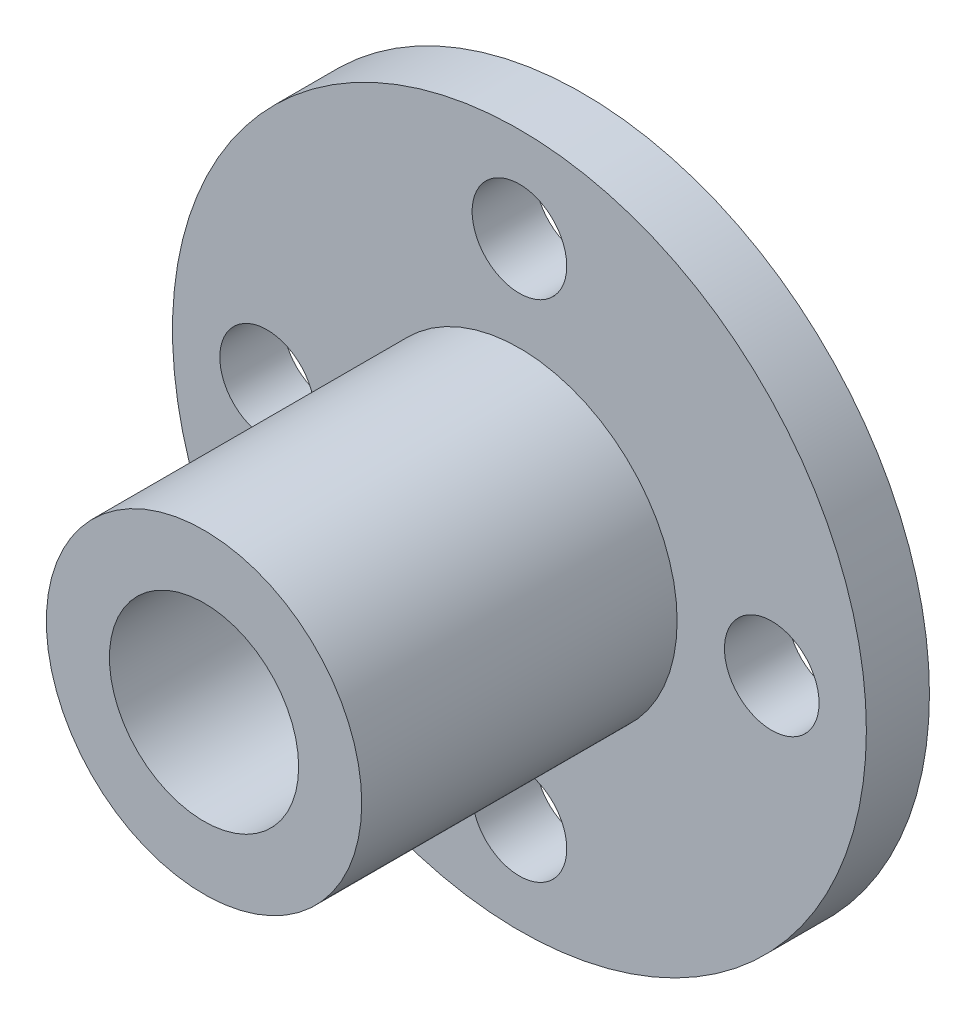
ISO-10303-21;
HEADER;
FILE_DESCRIPTION(('STEP AP214'),'2;1');
FILE_NAME('part.step','',(''),(''),'','','');
FILE_SCHEMA(('AUTOMOTIVE_DESIGN { 1 0 10303 214 1 1 1 1 }'));
ENDSEC;
DATA;
#1=APPLICATION_CONTEXT('core data for automotive mechanical design processes');
#2=APPLICATION_PROTOCOL_DEFINITION('international standard','automotive_design',2000,#1);
#3=PRODUCT_CONTEXT('',#1,'mechanical');
#4=PRODUCT('Part','Part','',(#3));
#5=PRODUCT_RELATED_PRODUCT_CATEGORY('part','',(#4));
#6=PRODUCT_DEFINITION_FORMATION('','',#4);
#7=PRODUCT_DEFINITION_CONTEXT('part definition',#1,'design');
#8=PRODUCT_DEFINITION('design','',#6,#7);
#9=PRODUCT_DEFINITION_SHAPE('','',#8);
#10=(LENGTH_UNIT() NAMED_UNIT(*) SI_UNIT(.MILLI.,.METRE.));
#11=(NAMED_UNIT(*) PLANE_ANGLE_UNIT() SI_UNIT($,.RADIAN.));
#12=(NAMED_UNIT(*) SI_UNIT($,.STERADIAN.) SOLID_ANGLE_UNIT());
#13=UNCERTAINTY_MEASURE_WITH_UNIT(LENGTH_MEASURE(1.E-05),#10,'distance_accuracy_value','');
#14=(GEOMETRIC_REPRESENTATION_CONTEXT(3) GLOBAL_UNCERTAINTY_ASSIGNED_CONTEXT((#13)) GLOBAL_UNIT_ASSIGNED_CONTEXT((#10,
#11,#12)) REPRESENTATION_CONTEXT('',''));
#15=CARTESIAN_POINT('',(0.,0.,0.));
#16=DIRECTION('',(0.,0.,1.));
#17=DIRECTION('',(1.,0.,0.));
#18=AXIS2_PLACEMENT_3D('',#15,#16,#17);
#19=CARTESIAN_POINT('',(0.,0.,2.));
#20=DIRECTION('',(0.,0.,-1.));
#21=DIRECTION('',(-1.,0.,0.));
#22=AXIS2_PLACEMENT_3D('',#19,#20,#21);
#23=CYLINDRICAL_SURFACE('',#22,11.);
#24=CARTESIAN_POINT('',(0.,0.,2.));
#25=DIRECTION('',(0.,0.,1.));
#26=DIRECTION('',(1.,0.,0.));
#27=AXIS2_PLACEMENT_3D('',#24,#25,#26);
#28=CIRCLE('',#27,11.);
#29=CARTESIAN_POINT('',(11.,0.,2.));
#30=VERTEX_POINT('',#29);
#31=EDGE_CURVE('E41',#30,#30,#28,.T.);
#32=ORIENTED_EDGE('',*,*,#31,.F.);
#33=EDGE_LOOP('',(#32));
#34=FACE_BOUND('',#33,.T.);
#35=CARTESIAN_POINT('',(0.,0.,0.));
#36=DIRECTION('',(0.,0.,1.));
#37=DIRECTION('',(1.,0.,0.));
#38=AXIS2_PLACEMENT_3D('',#35,#36,#37);
#39=CIRCLE('',#38,11.);
#40=CARTESIAN_POINT('',(11.,0.,0.));
#41=VERTEX_POINT('',#40);
#42=EDGE_CURVE('E37',#41,#41,#39,.T.);
#43=ORIENTED_EDGE('',*,*,#42,.T.);
#44=EDGE_LOOP('',(#43));
#45=FACE_BOUND('',#44,.T.);
#46=ADVANCED_FACE('F34',(#34,#45),#23,.T.);
#47=CARTESIAN_POINT('',(0.,0.,2.));
#48=DIRECTION('',(0.,0.,1.));
#49=DIRECTION('',(1.,0.,0.));
#50=AXIS2_PLACEMENT_3D('',#47,#48,#49);
#51=PLANE('',#50);
#52=CARTESIAN_POINT('',(-8.,0.,2.));
#53=DIRECTION('',(0.,0.,1.));
#54=DIRECTION('',(1.,0.,0.));
#55=AXIS2_PLACEMENT_3D('',#52,#53,#54);
#56=CIRCLE('',#55,1.5);
#57=CARTESIAN_POINT('',(-6.5,0.,2.));
#58=VERTEX_POINT('',#57);
#59=EDGE_CURVE('E73',#58,#58,#56,.T.);
#60=ORIENTED_EDGE('',*,*,#59,.F.);
#61=EDGE_LOOP('',(#60));
#62=FACE_BOUND('',#61,.T.);
#63=CARTESIAN_POINT('',(0.,8.,2.));
#64=DIRECTION('',(0.,0.,1.));
#65=DIRECTION('',(1.,0.,0.));
#66=AXIS2_PLACEMENT_3D('',#63,#64,#65);
#67=CIRCLE('',#66,1.5);
#68=CARTESIAN_POINT('',(1.50000000000003,8.,2.));
#69=VERTEX_POINT('',#68);
#70=EDGE_CURVE('E67',#69,#69,#67,.T.);
#71=ORIENTED_EDGE('',*,*,#70,.F.);
#72=EDGE_LOOP('',(#71));
#73=FACE_BOUND('',#72,.T.);
#74=CARTESIAN_POINT('',(8.,0.,2.));
#75=DIRECTION('',(0.,0.,1.));
#76=DIRECTION('',(1.,0.,0.));
#77=AXIS2_PLACEMENT_3D('',#74,#75,#76);
#78=CIRCLE('',#77,1.5);
#79=CARTESIAN_POINT('',(9.5,0.,2.));
#80=VERTEX_POINT('',#79);
#81=EDGE_CURVE('E60',#80,#80,#78,.T.);
#82=ORIENTED_EDGE('',*,*,#81,.F.);
#83=EDGE_LOOP('',(#82));
#84=FACE_BOUND('',#83,.T.);
#85=CARTESIAN_POINT('',(0.,-8.,2.));
#86=DIRECTION('',(0.,0.,1.));
#87=DIRECTION('',(1.,0.,0.));
#88=AXIS2_PLACEMENT_3D('',#85,#86,#87);
#89=CIRCLE('',#88,1.5);
#90=CARTESIAN_POINT('',(1.49999999999992,-8.,2.));
#91=VERTEX_POINT('',#90);
#92=EDGE_CURVE('E61',#91,#91,#89,.T.);
#93=ORIENTED_EDGE('',*,*,#92,.F.);
#94=EDGE_LOOP('',(#93));
#95=FACE_BOUND('',#94,.T.);
#96=CARTESIAN_POINT('',(0.,0.,2.));
#97=DIRECTION('',(0.,0.,1.));
#98=DIRECTION('',(1.,0.,0.));
#99=AXIS2_PLACEMENT_3D('',#96,#97,#98);
#100=CIRCLE('',#99,5.);
#101=CARTESIAN_POINT('',(5.,0.,2.));
#102=VERTEX_POINT('',#101);
#103=EDGE_CURVE('E10',#102,#102,#100,.T.);
#104=ORIENTED_EDGE('',*,*,#103,.F.);
#105=EDGE_LOOP('',(#104));
#106=FACE_BOUND('',#105,.T.);
#107=ORIENTED_EDGE('',*,*,#31,.T.);
#108=EDGE_LOOP('',(#107));
#109=FACE_BOUND('',#108,.T.);
#110=ADVANCED_FACE('F84',(#62,#73,#84,#95,#106,#109),#51,.T.);
#111=CARTESIAN_POINT('',(0.,0.,0.));
#112=DIRECTION('',(0.,0.,1.));
#113=DIRECTION('',(1.,0.,0.));
#114=AXIS2_PLACEMENT_3D('',#111,#112,#113);
#115=PLANE('',#114);
#116=CARTESIAN_POINT('',(-8.,0.,0.));
#117=DIRECTION('',(0.,0.,1.));
#118=DIRECTION('',(1.,0.,0.));
#119=AXIS2_PLACEMENT_3D('',#116,#117,#118);
#120=CIRCLE('',#119,1.5);
#121=CARTESIAN_POINT('',(-6.5,0.,0.));
#122=VERTEX_POINT('',#121);
#123=EDGE_CURVE('E54',#122,#122,#120,.F.);
#124=ORIENTED_EDGE('',*,*,#123,.F.);
#125=EDGE_LOOP('',(#124));
#126=FACE_BOUND('',#125,.T.);
#127=CARTESIAN_POINT('',(0.,8.,0.));
#128=DIRECTION('',(0.,0.,1.));
#129=DIRECTION('',(1.,0.,0.));
#130=AXIS2_PLACEMENT_3D('',#127,#128,#129);
#131=CIRCLE('',#130,1.5);
#132=CARTESIAN_POINT('',(1.50000000000003,8.,0.));
#133=VERTEX_POINT('',#132);
#134=EDGE_CURVE('E70',#133,#133,#131,.F.);
#135=ORIENTED_EDGE('',*,*,#134,.F.);
#136=EDGE_LOOP('',(#135));
#137=FACE_BOUND('',#136,.T.);
#138=CARTESIAN_POINT('',(8.,0.,0.));
#139=DIRECTION('',(0.,0.,1.));
#140=DIRECTION('',(1.,0.,0.));
#141=AXIS2_PLACEMENT_3D('',#138,#139,#140);
#142=CIRCLE('',#141,1.5);
#143=CARTESIAN_POINT('',(9.5,0.,0.));
#144=VERTEX_POINT('',#143);
#145=EDGE_CURVE('E64',#144,#144,#142,.F.);
#146=ORIENTED_EDGE('',*,*,#145,.F.);
#147=EDGE_LOOP('',(#146));
#148=FACE_BOUND('',#147,.T.);
#149=CARTESIAN_POINT('',(0.,-8.,0.));
#150=DIRECTION('',(0.,0.,1.));
#151=DIRECTION('',(1.,0.,0.));
#152=AXIS2_PLACEMENT_3D('',#149,#150,#151);
#153=CIRCLE('',#152,1.5);
#154=CARTESIAN_POINT('',(1.49999999999992,-8.,0.));
#155=VERTEX_POINT('',#154);
#156=EDGE_CURVE('E57',#155,#155,#153,.F.);
#157=ORIENTED_EDGE('',*,*,#156,.F.);
#158=EDGE_LOOP('',(#157));
#159=FACE_BOUND('',#158,.T.);
#160=CARTESIAN_POINT('',(0.,0.,0.));
#161=DIRECTION('',(0.,0.,1.));
#162=DIRECTION('',(1.,0.,0.));
#163=AXIS2_PLACEMENT_3D('',#160,#161,#162);
#164=CIRCLE('',#163,3.);
#165=CARTESIAN_POINT('',(3.,0.,0.));
#166=VERTEX_POINT('',#165);
#167=EDGE_CURVE('E50',#166,#166,#164,.T.);
#168=ORIENTED_EDGE('',*,*,#167,.T.);
#169=EDGE_LOOP('',(#168));
#170=FACE_BOUND('',#169,.T.);
#171=ORIENTED_EDGE('',*,*,#42,.F.);
#172=EDGE_LOOP('',(#171));
#173=FACE_BOUND('',#172,.T.);
#174=ADVANCED_FACE('F87',(#126,#137,#148,#159,#170,#173),#115,.F.);
#175=CARTESIAN_POINT('',(0.,0.,12.));
#176=DIRECTION('',(0.,0.,-1.));
#177=DIRECTION('',(-1.,0.,0.));
#178=AXIS2_PLACEMENT_3D('',#175,#176,#177);
#179=CYLINDRICAL_SURFACE('',#178,5.);
#180=CARTESIAN_POINT('',(0.,0.,12.));
#181=DIRECTION('',(0.,0.,1.));
#182=DIRECTION('',(1.,0.,0.));
#183=AXIS2_PLACEMENT_3D('',#180,#181,#182);
#184=CIRCLE('',#183,5.);
#185=CARTESIAN_POINT('',(5.,0.,12.));
#186=VERTEX_POINT('',#185);
#187=EDGE_CURVE('E47',#186,#186,#184,.T.);
#188=ORIENTED_EDGE('',*,*,#187,.F.);
#189=EDGE_LOOP('',(#188));
#190=FACE_BOUND('',#189,.T.);
#191=ORIENTED_EDGE('',*,*,#103,.T.);
#192=EDGE_LOOP('',(#191));
#193=FACE_BOUND('',#192,.T.);
#194=ADVANCED_FACE('F104',(#190,#193),#179,.T.);
#195=CARTESIAN_POINT('',(0.,0.,12.));
#196=DIRECTION('',(0.,0.,1.));
#197=DIRECTION('',(1.,0.,0.));
#198=AXIS2_PLACEMENT_3D('',#195,#196,#197);
#199=PLANE('',#198);
#200=CARTESIAN_POINT('',(0.,0.,12.));
#201=DIRECTION('',(0.,0.,1.));
#202=DIRECTION('',(1.,0.,0.));
#203=AXIS2_PLACEMENT_3D('',#200,#201,#202);
#204=CIRCLE('',#203,3.);
#205=CARTESIAN_POINT('',(3.,0.,12.));
#206=VERTEX_POINT('',#205);
#207=EDGE_CURVE('E51',#206,#206,#204,.T.);
#208=ORIENTED_EDGE('',*,*,#207,.F.);
#209=EDGE_LOOP('',(#208));
#210=FACE_BOUND('',#209,.T.);
#211=ORIENTED_EDGE('',*,*,#187,.T.);
#212=EDGE_LOOP('',(#211));
#213=FACE_BOUND('',#212,.T.);
#214=ADVANCED_FACE('F109',(#210,#213),#199,.T.);
#215=CARTESIAN_POINT('',(0.,0.,0.));
#216=DIRECTION('',(0.,0.,1.));
#217=DIRECTION('',(1.,0.,0.));
#218=AXIS2_PLACEMENT_3D('',#215,#216,#217);
#219=CYLINDRICAL_SURFACE('',#218,3.);
#220=ORIENTED_EDGE('',*,*,#167,.F.);
#221=EDGE_LOOP('',(#220));
#222=FACE_BOUND('',#221,.T.);
#223=ORIENTED_EDGE('',*,*,#207,.T.);
#224=EDGE_LOOP('',(#223));
#225=FACE_BOUND('',#224,.T.);
#226=ADVANCED_FACE('F117',(#222,#225),#219,.F.);
#227=CARTESIAN_POINT('',(0.,-8.,-0.00100000000000013));
#228=DIRECTION('',(0.,0.,1.));
#229=DIRECTION('',(1.,0.,0.));
#230=AXIS2_PLACEMENT_3D('',#227,#228,#229);
#231=CYLINDRICAL_SURFACE('',#230,1.5);
#232=ORIENTED_EDGE('',*,*,#92,.T.);
#233=EDGE_LOOP('',(#232));
#234=FACE_BOUND('',#233,.T.);
#235=ORIENTED_EDGE('',*,*,#156,.T.);
#236=EDGE_LOOP('',(#235));
#237=FACE_BOUND('',#236,.T.);
#238=ADVANCED_FACE('F121',(#234,#237),#231,.F.);
#239=CARTESIAN_POINT('',(8.,0.,-0.00100000000000013));
#240=DIRECTION('',(0.,0.,1.));
#241=DIRECTION('',(1.,0.,0.));
#242=AXIS2_PLACEMENT_3D('',#239,#240,#241);
#243=CYLINDRICAL_SURFACE('',#242,1.5);
#244=ORIENTED_EDGE('',*,*,#81,.T.);
#245=EDGE_LOOP('',(#244));
#246=FACE_BOUND('',#245,.T.);
#247=ORIENTED_EDGE('',*,*,#145,.T.);
#248=EDGE_LOOP('',(#247));
#249=FACE_BOUND('',#248,.T.);
#250=ADVANCED_FACE('F125',(#246,#249),#243,.F.);
#251=CARTESIAN_POINT('',(0.,8.,-0.00100000000000013));
#252=DIRECTION('',(0.,0.,1.));
#253=DIRECTION('',(1.,0.,0.));
#254=AXIS2_PLACEMENT_3D('',#251,#252,#253);
#255=CYLINDRICAL_SURFACE('',#254,1.5);
#256=ORIENTED_EDGE('',*,*,#70,.T.);
#257=EDGE_LOOP('',(#256));
#258=FACE_BOUND('',#257,.T.);
#259=ORIENTED_EDGE('',*,*,#134,.T.);
#260=EDGE_LOOP('',(#259));
#261=FACE_BOUND('',#260,.T.);
#262=ADVANCED_FACE('F129',(#258,#261),#255,.F.);
#263=CARTESIAN_POINT('',(-8.,0.,-0.00100000000000013));
#264=DIRECTION('',(0.,0.,1.));
#265=DIRECTION('',(1.,0.,0.));
#266=AXIS2_PLACEMENT_3D('',#263,#264,#265);
#267=CYLINDRICAL_SURFACE('',#266,1.5);
#268=ORIENTED_EDGE('',*,*,#59,.T.);
#269=EDGE_LOOP('',(#268));
#270=FACE_BOUND('',#269,.T.);
#271=ORIENTED_EDGE('',*,*,#123,.T.);
#272=EDGE_LOOP('',(#271));
#273=FACE_BOUND('',#272,.T.);
#274=ADVANCED_FACE('F81',(#270,#273),#267,.F.);
#275=CLOSED_SHELL('',(#46,#110,#174,#194,#214,#226,#238,#250,#262,#274));
#276=MANIFOLD_SOLID_BREP('B2',#275);
#277=ADVANCED_BREP_SHAPE_REPRESENTATION('',(#18,#276),#14);
#278=SHAPE_DEFINITION_REPRESENTATION(#9,#277);
ENDSEC;
END-ISO-10303-21;
